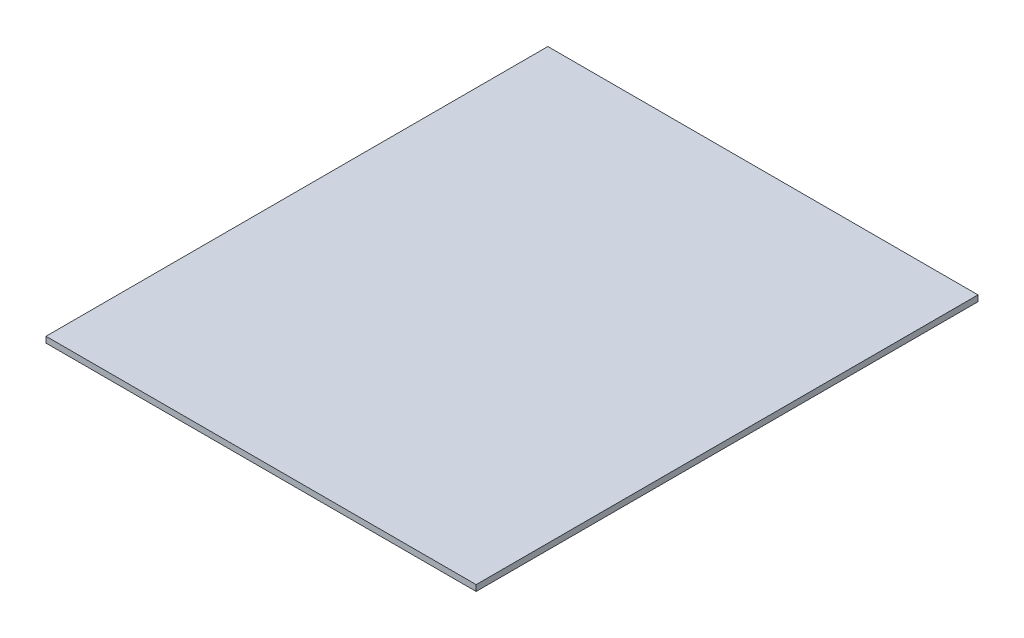
ISO-10303-21;
HEADER;
FILE_DESCRIPTION(('STEP AP214'),'2;1');
FILE_NAME('part.step','',(''),(''),'','','');
FILE_SCHEMA(('AUTOMOTIVE_DESIGN { 1 0 10303 214 1 1 1 1 }'));
ENDSEC;
DATA;
#1=APPLICATION_CONTEXT('core data for automotive mechanical design processes');
#2=APPLICATION_PROTOCOL_DEFINITION('international standard','automotive_design',2000,#1);
#3=PRODUCT_CONTEXT('',#1,'mechanical');
#4=PRODUCT('Part','Part','',(#3));
#5=PRODUCT_RELATED_PRODUCT_CATEGORY('part','',(#4));
#6=PRODUCT_DEFINITION_FORMATION('','',#4);
#7=PRODUCT_DEFINITION_CONTEXT('part definition',#1,'design');
#8=PRODUCT_DEFINITION('design','',#6,#7);
#9=PRODUCT_DEFINITION_SHAPE('','',#8);
#10=(LENGTH_UNIT() NAMED_UNIT(*) SI_UNIT(.MILLI.,.METRE.));
#11=(NAMED_UNIT(*) PLANE_ANGLE_UNIT() SI_UNIT($,.RADIAN.));
#12=(NAMED_UNIT(*) SI_UNIT($,.STERADIAN.) SOLID_ANGLE_UNIT());
#13=UNCERTAINTY_MEASURE_WITH_UNIT(LENGTH_MEASURE(1.E-05),#10,'distance_accuracy_value','');
#14=(GEOMETRIC_REPRESENTATION_CONTEXT(3) GLOBAL_UNCERTAINTY_ASSIGNED_CONTEXT((#13)) GLOBAL_UNIT_ASSIGNED_CONTEXT((#10,
#11,#12)) REPRESENTATION_CONTEXT('',''));
#15=CARTESIAN_POINT('',(0.,0.,0.));
#16=DIRECTION('',(0.,0.,1.));
#17=DIRECTION('',(1.,0.,0.));
#18=AXIS2_PLACEMENT_3D('',#15,#16,#17);
#19=CARTESIAN_POINT('',(114.3,3.175,-133.35));
#20=DIRECTION('',(-1.,0.,0.));
#21=DIRECTION('',(0.,0.,1.));
#22=AXIS2_PLACEMENT_3D('',#19,#20,#21);
#23=PLANE('',#22);
#24=DIRECTION('',(0.,0.,-1.));
#25=VECTOR('',#24,1.);
#26=CARTESIAN_POINT('',(114.3,0.,-133.35));
#27=LINE('',#26,#25);
#28=CARTESIAN_POINT('',(114.3,0.,133.35));
#29=VERTEX_POINT('',#28);
#30=CARTESIAN_POINT('',(114.3,0.,-133.35));
#31=VERTEX_POINT('',#30);
#32=EDGE_CURVE('E107',#29,#31,#27,.T.);
#33=ORIENTED_EDGE('',*,*,#32,.T.);
#34=DIRECTION('',(0.,-1.,0.));
#35=VECTOR('',#34,1.);
#36=CARTESIAN_POINT('',(114.3,3.175,-133.35));
#37=LINE('',#36,#35);
#38=CARTESIAN_POINT('',(114.3,3.175,-133.35));
#39=VERTEX_POINT('',#38);
#40=EDGE_CURVE('E11',#39,#31,#37,.T.);
#41=ORIENTED_EDGE('',*,*,#40,.F.);
#42=DIRECTION('',(0.,0.,-1.));
#43=VECTOR('',#42,1.);
#44=CARTESIAN_POINT('',(114.3,3.175,-133.35));
#45=LINE('',#44,#43);
#46=CARTESIAN_POINT('',(114.3,3.175,133.35));
#47=VERTEX_POINT('',#46);
#48=EDGE_CURVE('E91',#47,#39,#45,.T.);
#49=ORIENTED_EDGE('',*,*,#48,.F.);
#50=DIRECTION('',(0.,-1.,0.));
#51=VECTOR('',#50,1.);
#52=CARTESIAN_POINT('',(114.3,3.175,133.35));
#53=LINE('',#52,#51);
#54=EDGE_CURVE('E103',#47,#29,#53,.T.);
#55=ORIENTED_EDGE('',*,*,#54,.T.);
#56=EDGE_LOOP('',(#33,#41,#49,#55));
#57=FACE_BOUND('',#56,.T.);
#58=ADVANCED_FACE('F39',(#57),#23,.F.);
#59=CARTESIAN_POINT('',(-114.3,3.175,-133.35));
#60=DIRECTION('',(0.,0.,1.));
#61=DIRECTION('',(1.,0.,0.));
#62=AXIS2_PLACEMENT_3D('',#59,#60,#61);
#63=PLANE('',#62);
#64=DIRECTION('',(-1.,0.,0.));
#65=VECTOR('',#64,1.);
#66=CARTESIAN_POINT('',(-114.3,0.,-133.35));
#67=LINE('',#66,#65);
#68=CARTESIAN_POINT('',(-114.3,0.,-133.35));
#69=VERTEX_POINT('',#68);
#70=EDGE_CURVE('E96',#31,#69,#67,.T.);
#71=ORIENTED_EDGE('',*,*,#70,.T.);
#72=DIRECTION('',(0.,-1.,0.));
#73=VECTOR('',#72,1.);
#74=CARTESIAN_POINT('',(-114.3,3.175,-133.35));
#75=LINE('',#74,#73);
#76=CARTESIAN_POINT('',(-114.3,3.175,-133.35));
#77=VERTEX_POINT('',#76);
#78=EDGE_CURVE('E48',#77,#69,#75,.T.);
#79=ORIENTED_EDGE('',*,*,#78,.F.);
#80=DIRECTION('',(-1.,0.,0.));
#81=VECTOR('',#80,1.);
#82=CARTESIAN_POINT('',(-114.3,3.175,-133.35));
#83=LINE('',#82,#81);
#84=EDGE_CURVE('E86',#39,#77,#83,.T.);
#85=ORIENTED_EDGE('',*,*,#84,.F.);
#86=ORIENTED_EDGE('',*,*,#40,.T.);
#87=EDGE_LOOP('',(#71,#79,#85,#86));
#88=FACE_BOUND('',#87,.T.);
#89=ADVANCED_FACE('F95',(#88),#63,.F.);
#90=CARTESIAN_POINT('',(-114.3,3.175,-133.35));
#91=DIRECTION('',(1.,0.,0.));
#92=DIRECTION('',(0.,0.,-1.));
#93=AXIS2_PLACEMENT_3D('',#90,#91,#92);
#94=PLANE('',#93);
#95=DIRECTION('',(0.,0.,1.));
#96=VECTOR('',#95,1.);
#97=CARTESIAN_POINT('',(-114.3,0.,-133.35));
#98=LINE('',#97,#96);
#99=CARTESIAN_POINT('',(-114.3,0.,133.35));
#100=VERTEX_POINT('',#99);
#101=EDGE_CURVE('E73',#69,#100,#98,.T.);
#102=ORIENTED_EDGE('',*,*,#101,.T.);
#103=DIRECTION('',(0.,-1.,0.));
#104=VECTOR('',#103,1.);
#105=CARTESIAN_POINT('',(-114.3,3.175,133.35));
#106=LINE('',#105,#104);
#107=CARTESIAN_POINT('',(-114.3,3.175,133.35));
#108=VERTEX_POINT('',#107);
#109=EDGE_CURVE('E98',#108,#100,#106,.T.);
#110=ORIENTED_EDGE('',*,*,#109,.F.);
#111=DIRECTION('',(0.,0.,1.));
#112=VECTOR('',#111,1.);
#113=CARTESIAN_POINT('',(-114.3,3.175,-133.35));
#114=LINE('',#113,#112);
#115=EDGE_CURVE('E89',#77,#108,#114,.T.);
#116=ORIENTED_EDGE('',*,*,#115,.F.);
#117=ORIENTED_EDGE('',*,*,#78,.T.);
#118=EDGE_LOOP('',(#102,#110,#116,#117));
#119=FACE_BOUND('',#118,.T.);
#120=ADVANCED_FACE('F99',(#119),#94,.F.);
#121=CARTESIAN_POINT('',(-114.3,3.175,133.35));
#122=DIRECTION('',(0.,0.,-1.));
#123=DIRECTION('',(-1.,0.,0.));
#124=AXIS2_PLACEMENT_3D('',#121,#122,#123);
#125=PLANE('',#124);
#126=DIRECTION('',(1.,0.,0.));
#127=VECTOR('',#126,1.);
#128=CARTESIAN_POINT('',(-114.3,0.,133.35));
#129=LINE('',#128,#127);
#130=EDGE_CURVE('E79',#100,#29,#129,.T.);
#131=ORIENTED_EDGE('',*,*,#130,.T.);
#132=ORIENTED_EDGE('',*,*,#54,.F.);
#133=DIRECTION('',(1.,0.,0.));
#134=VECTOR('',#133,1.);
#135=CARTESIAN_POINT('',(-114.3,3.175,133.35));
#136=LINE('',#135,#134);
#137=EDGE_CURVE('E56',#108,#47,#136,.T.);
#138=ORIENTED_EDGE('',*,*,#137,.F.);
#139=ORIENTED_EDGE('',*,*,#109,.T.);
#140=EDGE_LOOP('',(#131,#132,#138,#139));
#141=FACE_BOUND('',#140,.T.);
#142=ADVANCED_FACE('F120',(#141),#125,.F.);
#143=CARTESIAN_POINT('',(0.,3.175,0.));
#144=DIRECTION('',(0.,1.,0.));
#145=DIRECTION('',(0.,0.,1.));
#146=AXIS2_PLACEMENT_3D('',#143,#144,#145);
#147=PLANE('',#146);
#148=ORIENTED_EDGE('',*,*,#48,.T.);
#149=ORIENTED_EDGE('',*,*,#84,.T.);
#150=ORIENTED_EDGE('',*,*,#115,.T.);
#151=ORIENTED_EDGE('',*,*,#137,.T.);
#152=EDGE_LOOP('',(#148,#149,#150,#151));
#153=FACE_BOUND('',#152,.T.);
#154=ADVANCED_FACE('F87',(#153),#147,.T.);
#155=CARTESIAN_POINT('',(0.,0.,0.));
#156=DIRECTION('',(0.,1.,0.));
#157=DIRECTION('',(0.,0.,1.));
#158=AXIS2_PLACEMENT_3D('',#155,#156,#157);
#159=PLANE('',#158);
#160=ORIENTED_EDGE('',*,*,#32,.F.);
#161=ORIENTED_EDGE('',*,*,#130,.F.);
#162=ORIENTED_EDGE('',*,*,#101,.F.);
#163=ORIENTED_EDGE('',*,*,#70,.F.);
#164=EDGE_LOOP('',(#160,#161,#162,#163));
#165=FACE_BOUND('',#164,.T.);
#166=ADVANCED_FACE('F123',(#165),#159,.F.);
#167=CLOSED_SHELL('',(#58,#89,#120,#142,#154,#166));
#168=MANIFOLD_SOLID_BREP('B2',#167);
#169=ADVANCED_BREP_SHAPE_REPRESENTATION('',(#18,#168),#14);
#170=SHAPE_DEFINITION_REPRESENTATION(#9,#169);
ENDSEC;
END-ISO-10303-21;
